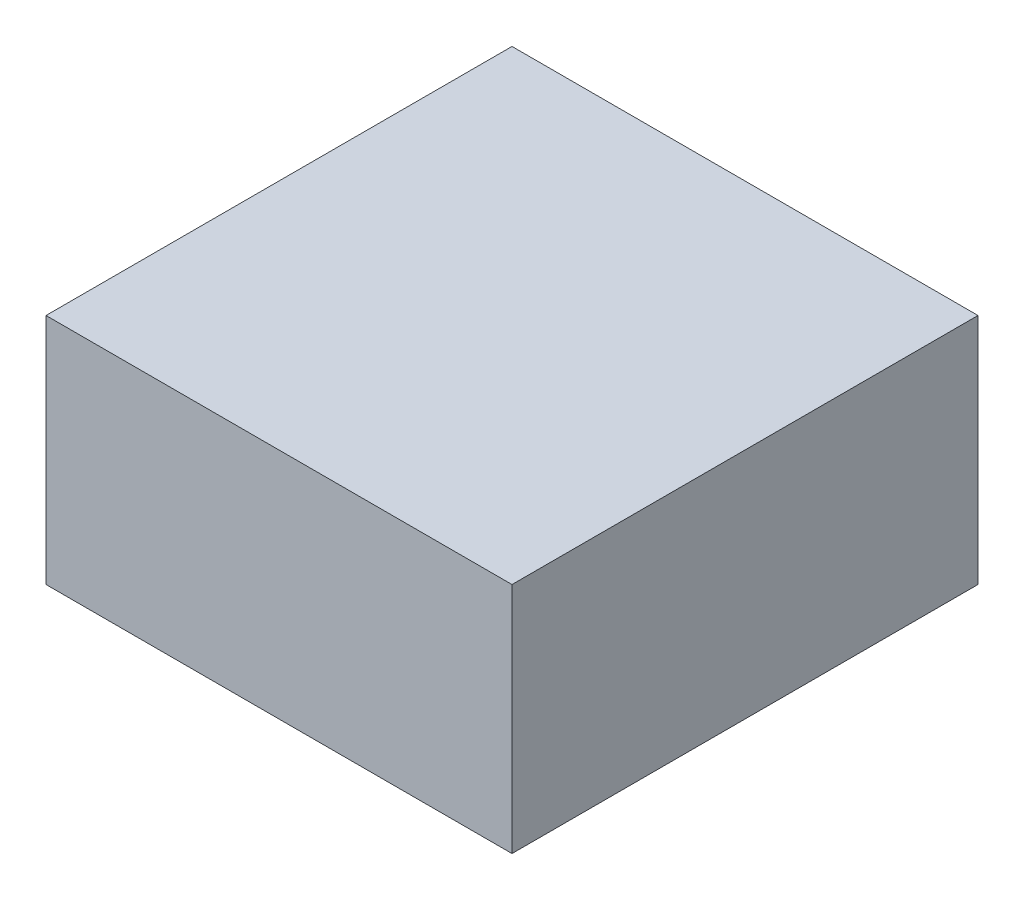
ISO-10303-21;
HEADER;
FILE_DESCRIPTION(('STEP AP214'),'2;1');
FILE_NAME('part.step','',(''),(''),'','','');
FILE_SCHEMA(('AUTOMOTIVE_DESIGN { 1 0 10303 214 1 1 1 1 }'));
ENDSEC;
DATA;
#1=APPLICATION_CONTEXT('core data for automotive mechanical design processes');
#2=APPLICATION_PROTOCOL_DEFINITION('international standard','automotive_design',2000,#1);
#3=PRODUCT_CONTEXT('',#1,'mechanical');
#4=PRODUCT('Part','Part','',(#3));
#5=PRODUCT_RELATED_PRODUCT_CATEGORY('part','',(#4));
#6=PRODUCT_DEFINITION_FORMATION('','',#4);
#7=PRODUCT_DEFINITION_CONTEXT('part definition',#1,'design');
#8=PRODUCT_DEFINITION('design','',#6,#7);
#9=PRODUCT_DEFINITION_SHAPE('','',#8);
#10=(LENGTH_UNIT() NAMED_UNIT(*) SI_UNIT(.MILLI.,.METRE.));
#11=(NAMED_UNIT(*) PLANE_ANGLE_UNIT() SI_UNIT($,.RADIAN.));
#12=(NAMED_UNIT(*) SI_UNIT($,.STERADIAN.) SOLID_ANGLE_UNIT());
#13=UNCERTAINTY_MEASURE_WITH_UNIT(LENGTH_MEASURE(1.E-05),#10,'distance_accuracy_value','');
#14=(GEOMETRIC_REPRESENTATION_CONTEXT(3) GLOBAL_UNCERTAINTY_ASSIGNED_CONTEXT((#13)) GLOBAL_UNIT_ASSIGNED_CONTEXT((#10,
#11,#12)) REPRESENTATION_CONTEXT('',''));
#15=CARTESIAN_POINT('',(0.,0.,0.));
#16=DIRECTION('',(0.,0.,1.));
#17=DIRECTION('',(1.,0.,0.));
#18=AXIS2_PLACEMENT_3D('',#15,#16,#17);
#19=CARTESIAN_POINT('',(0.,0.762,0.));
#20=DIRECTION('',(1.,0.,0.));
#21=DIRECTION('',(0.,0.,-1.));
#22=AXIS2_PLACEMENT_3D('',#19,#20,#21);
#23=PLANE('',#22);
#24=DIRECTION('',(0.,0.,1.));
#25=VECTOR('',#24,1.);
#26=CARTESIAN_POINT('',(0.,0.,0.));
#27=LINE('',#26,#25);
#28=CARTESIAN_POINT('',(0.,0.,-1.524));
#29=VERTEX_POINT('',#28);
#30=CARTESIAN_POINT('',(0.,0.,0.));
#31=VERTEX_POINT('',#30);
#32=EDGE_CURVE('E96',#29,#31,#27,.T.);
#33=ORIENTED_EDGE('',*,*,#32,.T.);
#34=DIRECTION('',(0.,-1.,0.));
#35=VECTOR('',#34,1.);
#36=CARTESIAN_POINT('',(0.,0.762,0.));
#37=LINE('',#36,#35);
#38=CARTESIAN_POINT('',(0.,0.762,0.));
#39=VERTEX_POINT('',#38);
#40=EDGE_CURVE('E11',#39,#31,#37,.T.);
#41=ORIENTED_EDGE('',*,*,#40,.F.);
#42=DIRECTION('',(0.,0.,1.));
#43=VECTOR('',#42,1.);
#44=CARTESIAN_POINT('',(0.,0.762,0.));
#45=LINE('',#44,#43);
#46=CARTESIAN_POINT('',(0.,0.762,-1.524));
#47=VERTEX_POINT('',#46);
#48=EDGE_CURVE('E84',#47,#39,#45,.T.);
#49=ORIENTED_EDGE('',*,*,#48,.F.);
#50=DIRECTION('',(0.,-1.,0.));
#51=VECTOR('',#50,1.);
#52=CARTESIAN_POINT('',(0.,0.762,-1.524));
#53=LINE('',#52,#51);
#54=EDGE_CURVE('E92',#47,#29,#53,.T.);
#55=ORIENTED_EDGE('',*,*,#54,.T.);
#56=EDGE_LOOP('',(#33,#41,#49,#55));
#57=FACE_BOUND('',#56,.T.);
#58=ADVANCED_FACE('F33',(#57),#23,.F.);
#59=CARTESIAN_POINT('',(0.,0.762,0.));
#60=DIRECTION('',(0.,0.,-1.));
#61=DIRECTION('',(-1.,0.,0.));
#62=AXIS2_PLACEMENT_3D('',#59,#60,#61);
#63=PLANE('',#62);
#64=DIRECTION('',(1.,0.,0.));
#65=VECTOR('',#64,1.);
#66=CARTESIAN_POINT('',(0.,0.,0.));
#67=LINE('',#66,#65);
#68=CARTESIAN_POINT('',(1.524,0.,0.));
#69=VERTEX_POINT('',#68);
#70=EDGE_CURVE('E88',#31,#69,#67,.T.);
#71=ORIENTED_EDGE('',*,*,#70,.T.);
#72=DIRECTION('',(0.,-1.,0.));
#73=VECTOR('',#72,1.);
#74=CARTESIAN_POINT('',(1.524,0.762,0.));
#75=LINE('',#74,#73);
#76=CARTESIAN_POINT('',(1.524,0.762,0.));
#77=VERTEX_POINT('',#76);
#78=EDGE_CURVE('E41',#77,#69,#75,.T.);
#79=ORIENTED_EDGE('',*,*,#78,.F.);
#80=DIRECTION('',(1.,0.,0.));
#81=VECTOR('',#80,1.);
#82=CARTESIAN_POINT('',(0.,0.762,0.));
#83=LINE('',#82,#81);
#84=EDGE_CURVE('E79',#39,#77,#83,.T.);
#85=ORIENTED_EDGE('',*,*,#84,.F.);
#86=ORIENTED_EDGE('',*,*,#40,.T.);
#87=EDGE_LOOP('',(#71,#79,#85,#86));
#88=FACE_BOUND('',#87,.T.);
#89=ADVANCED_FACE('F87',(#88),#63,.F.);
#90=CARTESIAN_POINT('',(1.524,0.762,0.));
#91=DIRECTION('',(-1.,0.,0.));
#92=DIRECTION('',(0.,0.,1.));
#93=AXIS2_PLACEMENT_3D('',#90,#91,#92);
#94=PLANE('',#93);
#95=DIRECTION('',(0.,0.,-1.));
#96=VECTOR('',#95,1.);
#97=CARTESIAN_POINT('',(1.524,0.,0.));
#98=LINE('',#97,#96);
#99=CARTESIAN_POINT('',(1.524,0.,-1.524));
#100=VERTEX_POINT('',#99);
#101=EDGE_CURVE('E66',#69,#100,#98,.T.);
#102=ORIENTED_EDGE('',*,*,#101,.T.);
#103=DIRECTION('',(0.,-1.,0.));
#104=VECTOR('',#103,1.);
#105=CARTESIAN_POINT('',(1.524,0.762,-1.524));
#106=LINE('',#105,#104);
#107=CARTESIAN_POINT('',(1.524,0.762,-1.524));
#108=VERTEX_POINT('',#107);
#109=EDGE_CURVE('E89',#108,#100,#106,.T.);
#110=ORIENTED_EDGE('',*,*,#109,.F.);
#111=DIRECTION('',(0.,0.,-1.));
#112=VECTOR('',#111,1.);
#113=CARTESIAN_POINT('',(1.524,0.762,0.));
#114=LINE('',#113,#112);
#115=EDGE_CURVE('E82',#77,#108,#114,.T.);
#116=ORIENTED_EDGE('',*,*,#115,.F.);
#117=ORIENTED_EDGE('',*,*,#78,.T.);
#118=EDGE_LOOP('',(#102,#110,#116,#117));
#119=FACE_BOUND('',#118,.T.);
#120=ADVANCED_FACE('F90',(#119),#94,.F.);
#121=CARTESIAN_POINT('',(0.,0.762,-1.524));
#122=DIRECTION('',(0.,0.,1.));
#123=DIRECTION('',(1.,0.,0.));
#124=AXIS2_PLACEMENT_3D('',#121,#122,#123);
#125=PLANE('',#124);
#126=DIRECTION('',(-1.,0.,0.));
#127=VECTOR('',#126,1.);
#128=CARTESIAN_POINT('',(0.,0.,-1.524));
#129=LINE('',#128,#127);
#130=EDGE_CURVE('E72',#100,#29,#129,.T.);
#131=ORIENTED_EDGE('',*,*,#130,.T.);
#132=ORIENTED_EDGE('',*,*,#54,.F.);
#133=DIRECTION('',(-1.,0.,0.));
#134=VECTOR('',#133,1.);
#135=CARTESIAN_POINT('',(0.,0.762,-1.524));
#136=LINE('',#135,#134);
#137=EDGE_CURVE('E49',#108,#47,#136,.T.);
#138=ORIENTED_EDGE('',*,*,#137,.F.);
#139=ORIENTED_EDGE('',*,*,#109,.T.);
#140=EDGE_LOOP('',(#131,#132,#138,#139));
#141=FACE_BOUND('',#140,.T.);
#142=ADVANCED_FACE('F103',(#141),#125,.F.);
#143=CARTESIAN_POINT('',(0.,0.762,0.));
#144=DIRECTION('',(0.,-1.,0.));
#145=DIRECTION('',(0.,0.,-1.));
#146=AXIS2_PLACEMENT_3D('',#143,#144,#145);
#147=PLANE('',#146);
#148=ORIENTED_EDGE('',*,*,#48,.T.);
#149=ORIENTED_EDGE('',*,*,#84,.T.);
#150=ORIENTED_EDGE('',*,*,#115,.T.);
#151=ORIENTED_EDGE('',*,*,#137,.T.);
#152=EDGE_LOOP('',(#148,#149,#150,#151));
#153=FACE_BOUND('',#152,.T.);
#154=ADVANCED_FACE('F80',(#153),#147,.F.);
#155=CARTESIAN_POINT('',(0.,0.,0.));
#156=DIRECTION('',(0.,-1.,0.));
#157=DIRECTION('',(0.,0.,-1.));
#158=AXIS2_PLACEMENT_3D('',#155,#156,#157);
#159=PLANE('',#158);
#160=ORIENTED_EDGE('',*,*,#32,.F.);
#161=ORIENTED_EDGE('',*,*,#130,.F.);
#162=ORIENTED_EDGE('',*,*,#101,.F.);
#163=ORIENTED_EDGE('',*,*,#70,.F.);
#164=EDGE_LOOP('',(#160,#161,#162,#163));
#165=FACE_BOUND('',#164,.T.);
#166=ADVANCED_FACE('F106',(#165),#159,.T.);
#167=CLOSED_SHELL('',(#58,#89,#120,#142,#154,#166));
#168=MANIFOLD_SOLID_BREP('B2',#167);
#169=ADVANCED_BREP_SHAPE_REPRESENTATION('',(#18,#168),#14);
#170=SHAPE_DEFINITION_REPRESENTATION(#9,#169);
ENDSEC;
END-ISO-10303-21;
